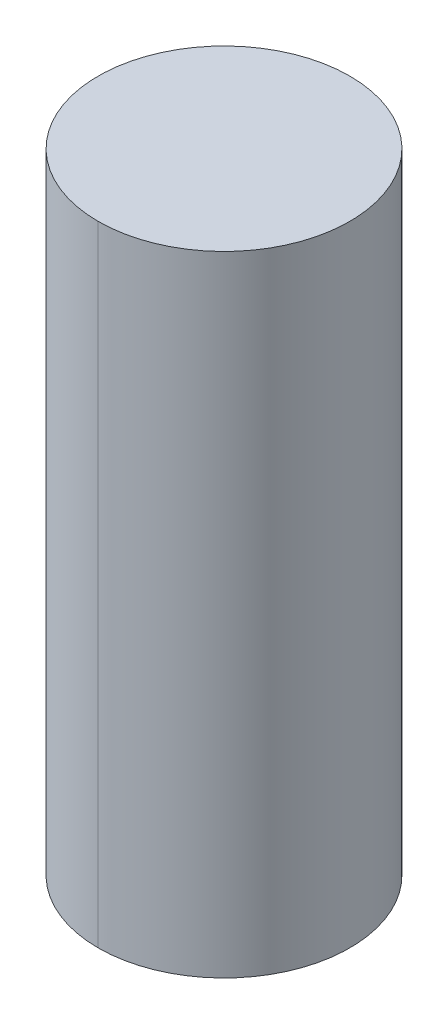
ISO-10303-21;
HEADER;
FILE_DESCRIPTION(('STEP AP214'),'2;1');
FILE_NAME('part.step','',(''),(''),'','','');
FILE_SCHEMA(('AUTOMOTIVE_DESIGN { 1 0 10303 214 1 1 1 1 }'));
ENDSEC;
DATA;
#1=APPLICATION_CONTEXT('core data for automotive mechanical design processes');
#2=APPLICATION_PROTOCOL_DEFINITION('international standard','automotive_design',2000,#1);
#3=PRODUCT_CONTEXT('',#1,'mechanical');
#4=PRODUCT('Part','Part','',(#3));
#5=PRODUCT_RELATED_PRODUCT_CATEGORY('part','',(#4));
#6=PRODUCT_DEFINITION_FORMATION('','',#4);
#7=PRODUCT_DEFINITION_CONTEXT('part definition',#1,'design');
#8=PRODUCT_DEFINITION('design','',#6,#7);
#9=PRODUCT_DEFINITION_SHAPE('','',#8);
#10=(LENGTH_UNIT() NAMED_UNIT(*) SI_UNIT(.MILLI.,.METRE.));
#11=(NAMED_UNIT(*) PLANE_ANGLE_UNIT() SI_UNIT($,.RADIAN.));
#12=(NAMED_UNIT(*) SI_UNIT($,.STERADIAN.) SOLID_ANGLE_UNIT());
#13=UNCERTAINTY_MEASURE_WITH_UNIT(LENGTH_MEASURE(1.E-05),#10,'distance_accuracy_value','');
#14=(GEOMETRIC_REPRESENTATION_CONTEXT(3) GLOBAL_UNCERTAINTY_ASSIGNED_CONTEXT((#13)) GLOBAL_UNIT_ASSIGNED_CONTEXT((#10,
#11,#12)) REPRESENTATION_CONTEXT('',''));
#15=CARTESIAN_POINT('',(0.,0.,0.));
#16=DIRECTION('',(0.,0.,1.));
#17=DIRECTION('',(1.,0.,0.));
#18=AXIS2_PLACEMENT_3D('',#15,#16,#17);
#19=CARTESIAN_POINT('',(0.,13.5,0.));
#20=DIRECTION('',(0.,-1.,0.));
#21=DIRECTION('',(0.,0.,-1.));
#22=AXIS2_PLACEMENT_3D('',#19,#20,#21);
#23=PLANE('',#22);
#24=CARTESIAN_POINT('',(0.,13.5,0.));
#25=DIRECTION('',(0.,-1.,0.));
#26=DIRECTION('',(0.,0.,-1.));
#27=AXIS2_PLACEMENT_3D('',#24,#25,#26);
#28=CIRCLE('',#27,1.);
#29=CARTESIAN_POINT('',(0.,13.5,1.));
#30=VERTEX_POINT('',#29);
#31=CARTESIAN_POINT('',(0.,13.5,-1.));
#32=VERTEX_POINT('',#31);
#33=EDGE_CURVE('E11',#30,#32,#28,.T.);
#34=ORIENTED_EDGE('',*,*,#33,.F.);
#35=CARTESIAN_POINT('',(0.,13.5,0.));
#36=DIRECTION('',(0.,-1.,0.));
#37=DIRECTION('',(0.,0.,-1.));
#38=AXIS2_PLACEMENT_3D('',#35,#36,#37);
#39=CIRCLE('',#38,1.);
#40=EDGE_CURVE('E28',#32,#30,#39,.T.);
#41=ORIENTED_EDGE('',*,*,#40,.F.);
#42=EDGE_LOOP('',(#34,#41));
#43=FACE_BOUND('',#42,.T.);
#44=ADVANCED_FACE('F19',(#43),#23,.F.);
#45=CARTESIAN_POINT('',(0.,8.5,0.));
#46=DIRECTION('',(0.,-1.,0.));
#47=DIRECTION('',(-1.,0.,0.));
#48=AXIS2_PLACEMENT_3D('',#45,#46,#47);
#49=CYLINDRICAL_SURFACE('',#48,1.);
#50=DIRECTION('',(0.,-1.,0.));
#51=VECTOR('',#50,1.);
#52=CARTESIAN_POINT('',(0.,13.5,1.));
#53=LINE('',#52,#51);
#54=CARTESIAN_POINT('',(0.,8.5,1.));
#55=VERTEX_POINT('',#54);
#56=EDGE_CURVE('E53',#30,#55,#53,.T.);
#57=ORIENTED_EDGE('',*,*,#56,.T.);
#58=CARTESIAN_POINT('',(0.,8.5,0.));
#59=DIRECTION('',(0.,-1.,0.));
#60=DIRECTION('',(0.,0.,-1.));
#61=AXIS2_PLACEMENT_3D('',#58,#59,#60);
#62=CIRCLE('',#61,1.);
#63=CARTESIAN_POINT('',(0.,8.5,-1.));
#64=VERTEX_POINT('',#63);
#65=EDGE_CURVE('E49',#64,#55,#62,.T.);
#66=ORIENTED_EDGE('',*,*,#65,.F.);
#67=DIRECTION('',(0.,-1.,0.));
#68=VECTOR('',#67,1.);
#69=CARTESIAN_POINT('',(0.,13.5,-1.));
#70=LINE('',#69,#68);
#71=EDGE_CURVE('E52',#32,#64,#70,.T.);
#72=ORIENTED_EDGE('',*,*,#71,.F.);
#73=ORIENTED_EDGE('',*,*,#40,.T.);
#74=EDGE_LOOP('',(#57,#66,#72,#73));
#75=FACE_BOUND('',#74,.T.);
#76=ADVANCED_FACE('F51',(#75),#49,.T.);
#77=CARTESIAN_POINT('',(0.,8.5,0.));
#78=DIRECTION('',(0.,-1.,0.));
#79=DIRECTION('',(1.,0.,0.));
#80=AXIS2_PLACEMENT_3D('',#77,#78,#79);
#81=CYLINDRICAL_SURFACE('',#80,1.);
#82=ORIENTED_EDGE('',*,*,#56,.F.);
#83=ORIENTED_EDGE('',*,*,#33,.T.);
#84=ORIENTED_EDGE('',*,*,#71,.T.);
#85=CARTESIAN_POINT('',(0.,8.5,0.));
#86=DIRECTION('',(0.,-1.,0.));
#87=DIRECTION('',(0.,0.,-1.));
#88=AXIS2_PLACEMENT_3D('',#85,#86,#87);
#89=CIRCLE('',#88,1.);
#90=EDGE_CURVE('E61',#55,#64,#89,.T.);
#91=ORIENTED_EDGE('',*,*,#90,.F.);
#92=EDGE_LOOP('',(#82,#83,#84,#91));
#93=FACE_BOUND('',#92,.T.);
#94=ADVANCED_FACE('F60',(#93),#81,.T.);
#95=CARTESIAN_POINT('',(0.,8.5,-1.));
#96=DIRECTION('',(0.,1.,0.));
#97=DIRECTION('',(0.,0.,1.));
#98=AXIS2_PLACEMENT_3D('',#95,#96,#97);
#99=PLANE('',#98);
#100=ORIENTED_EDGE('',*,*,#65,.T.);
#101=ORIENTED_EDGE('',*,*,#90,.T.);
#102=EDGE_LOOP('',(#100,#101));
#103=FACE_BOUND('',#102,.T.);
#104=ADVANCED_FACE('F64',(#103),#99,.F.);
#105=CLOSED_SHELL('',(#44,#76,#94,#104));
#106=MANIFOLD_SOLID_BREP('B1',#105);
#107=ADVANCED_BREP_SHAPE_REPRESENTATION('',(#18,#106),#14);
#108=SHAPE_DEFINITION_REPRESENTATION(#9,#107);
ENDSEC;
END-ISO-10303-21;
